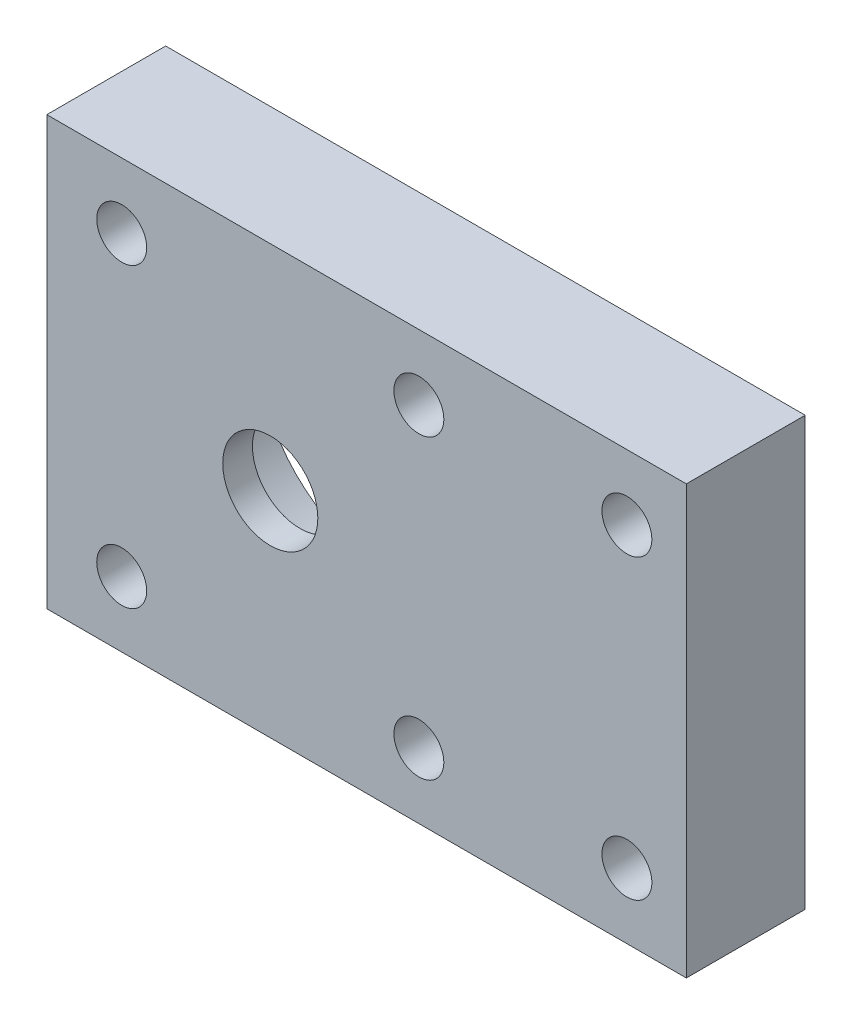
ISO-10303-21;
HEADER;
FILE_DESCRIPTION(('STEP AP214'),'2;1');
FILE_NAME('part.step','',(''),(''),'','','');
FILE_SCHEMA(('AUTOMOTIVE_DESIGN { 1 0 10303 214 1 1 1 1 }'));
ENDSEC;
DATA;
#1=APPLICATION_CONTEXT('core data for automotive mechanical design processes');
#2=APPLICATION_PROTOCOL_DEFINITION('international standard','automotive_design',2000,#1);
#3=PRODUCT_CONTEXT('',#1,'mechanical');
#4=PRODUCT('Part','Part','',(#3));
#5=PRODUCT_RELATED_PRODUCT_CATEGORY('part','',(#4));
#6=PRODUCT_DEFINITION_FORMATION('','',#4);
#7=PRODUCT_DEFINITION_CONTEXT('part definition',#1,'design');
#8=PRODUCT_DEFINITION('design','',#6,#7);
#9=PRODUCT_DEFINITION_SHAPE('','',#8);
#10=(LENGTH_UNIT() NAMED_UNIT(*) SI_UNIT(.MILLI.,.METRE.));
#11=(NAMED_UNIT(*) PLANE_ANGLE_UNIT() SI_UNIT($,.RADIAN.));
#12=(NAMED_UNIT(*) SI_UNIT($,.STERADIAN.) SOLID_ANGLE_UNIT());
#13=UNCERTAINTY_MEASURE_WITH_UNIT(LENGTH_MEASURE(1.E-05),#10,'distance_accuracy_value','');
#14=(GEOMETRIC_REPRESENTATION_CONTEXT(3) GLOBAL_UNCERTAINTY_ASSIGNED_CONTEXT((#13)) GLOBAL_UNIT_ASSIGNED_CONTEXT((#10,
#11,#12)) REPRESENTATION_CONTEXT('',''));
#15=CARTESIAN_POINT('',(0.,0.,0.));
#16=DIRECTION('',(0.,0.,1.));
#17=DIRECTION('',(1.,0.,0.));
#18=AXIS2_PLACEMENT_3D('',#15,#16,#17);
#19=CARTESIAN_POINT('',(0.,0.,10.));
#20=DIRECTION('',(0.,0.,1.));
#21=DIRECTION('',(1.,0.,0.));
#22=AXIS2_PLACEMENT_3D('',#19,#20,#21);
#23=PLANE('',#22);
#24=CARTESIAN_POINT('',(-5.,7.49999999999999,10.));
#25=DIRECTION('',(0.,0.,1.));
#26=DIRECTION('',(-1.,0.,0.));
#27=AXIS2_PLACEMENT_3D('',#24,#25,#26);
#28=CIRCLE('',#27,2.1);
#29=CARTESIAN_POINT('',(-7.09999999999999,7.49999999999999,10.));
#30=VERTEX_POINT('',#29);
#31=EDGE_CURVE('E125',#30,#30,#28,.T.);
#32=ORIENTED_EDGE('',*,*,#31,.F.);
#33=EDGE_LOOP('',(#32));
#34=FACE_BOUND('',#33,.T.);
#35=CARTESIAN_POINT('',(-22.5,7.5,10.));
#36=DIRECTION('',(0.,0.,1.));
#37=DIRECTION('',(1.,0.,0.));
#38=AXIS2_PLACEMENT_3D('',#35,#36,#37);
#39=CIRCLE('',#38,2.1);
#40=CARTESIAN_POINT('',(-20.4,7.5,10.));
#41=VERTEX_POINT('',#40);
#42=EDGE_CURVE('E113',#41,#41,#39,.T.);
#43=ORIENTED_EDGE('',*,*,#42,.F.);
#44=EDGE_LOOP('',(#43));
#45=FACE_BOUND('',#44,.T.);
#46=CARTESIAN_POINT('',(-47.5,7.49999999999998,10.));
#47=DIRECTION('',(0.,0.,1.));
#48=DIRECTION('',(-1.,0.,0.));
#49=AXIS2_PLACEMENT_3D('',#46,#47,#48);
#50=CIRCLE('',#49,2.1);
#51=CARTESIAN_POINT('',(-49.6,7.49999999999998,10.));
#52=VERTEX_POINT('',#51);
#53=EDGE_CURVE('E102',#52,#52,#50,.T.);
#54=ORIENTED_EDGE('',*,*,#53,.F.);
#55=EDGE_LOOP('',(#54));
#56=FACE_BOUND('',#55,.T.);
#57=CARTESIAN_POINT('',(-22.5,32.5,10.));
#58=DIRECTION('',(0.,0.,1.));
#59=DIRECTION('',(1.,0.,0.));
#60=AXIS2_PLACEMENT_3D('',#57,#58,#59);
#61=CIRCLE('',#60,2.1);
#62=CARTESIAN_POINT('',(-20.4,32.5,10.));
#63=VERTEX_POINT('',#62);
#64=EDGE_CURVE('E94',#63,#63,#61,.T.);
#65=ORIENTED_EDGE('',*,*,#64,.F.);
#66=EDGE_LOOP('',(#65));
#67=FACE_BOUND('',#66,.T.);
#68=CARTESIAN_POINT('',(-47.5,32.5,10.));
#69=DIRECTION('',(0.,0.,1.));
#70=DIRECTION('',(1.,0.,0.));
#71=AXIS2_PLACEMENT_3D('',#68,#69,#70);
#72=CIRCLE('',#71,2.1);
#73=CARTESIAN_POINT('',(-45.4,32.5,10.));
#74=VERTEX_POINT('',#73);
#75=EDGE_CURVE('E107',#74,#74,#72,.T.);
#76=ORIENTED_EDGE('',*,*,#75,.F.);
#77=EDGE_LOOP('',(#76));
#78=FACE_BOUND('',#77,.T.);
#79=CARTESIAN_POINT('',(-5.,32.5,10.));
#80=DIRECTION('',(0.,0.,1.));
#81=DIRECTION('',(1.,0.,0.));
#82=AXIS2_PLACEMENT_3D('',#79,#80,#81);
#83=CIRCLE('',#82,2.1);
#84=CARTESIAN_POINT('',(-2.9,32.5,10.));
#85=VERTEX_POINT('',#84);
#86=EDGE_CURVE('E119',#85,#85,#83,.T.);
#87=ORIENTED_EDGE('',*,*,#86,.F.);
#88=EDGE_LOOP('',(#87));
#89=FACE_BOUND('',#88,.T.);
#90=CARTESIAN_POINT('',(-35.,20.,10.));
#91=DIRECTION('',(0.,0.,1.));
#92=DIRECTION('',(1.,0.,0.));
#93=AXIS2_PLACEMENT_3D('',#90,#91,#92);
#94=CIRCLE('',#93,4.);
#95=CARTESIAN_POINT('',(-31.,20.,10.));
#96=VERTEX_POINT('',#95);
#97=EDGE_CURVE('E131',#96,#96,#94,.T.);
#98=ORIENTED_EDGE('',*,*,#97,.F.);
#99=EDGE_LOOP('',(#98));
#100=FACE_BOUND('',#99,.T.);
#101=DIRECTION('',(0.,1.,0.));
#102=VECTOR('',#101,1.);
#103=CARTESIAN_POINT('',(0.,0.,10.));
#104=LINE('',#103,#102);
#105=CARTESIAN_POINT('',(0.,2.,10.));
#106=VERTEX_POINT('',#105);
#107=CARTESIAN_POINT('',(0.,38.,10.));
#108=VERTEX_POINT('',#107);
#109=EDGE_CURVE('E43',#106,#108,#104,.T.);
#110=ORIENTED_EDGE('',*,*,#109,.T.);
#111=DIRECTION('',(1.,0.,0.));
#112=VECTOR('',#111,1.);
#113=CARTESIAN_POINT('',(-53.8,38.,10.));
#114=LINE('',#113,#112);
#115=CARTESIAN_POINT('',(-53.8,38.,10.));
#116=VERTEX_POINT('',#115);
#117=EDGE_CURVE('E77',#116,#108,#114,.T.);
#118=ORIENTED_EDGE('',*,*,#117,.F.);
#119=DIRECTION('',(0.,-1.,0.));
#120=VECTOR('',#119,1.);
#121=CARTESIAN_POINT('',(-53.8,0.,10.));
#122=LINE('',#121,#120);
#123=CARTESIAN_POINT('',(-53.8,2.,10.));
#124=VERTEX_POINT('',#123);
#125=EDGE_CURVE('E11',#116,#124,#122,.T.);
#126=ORIENTED_EDGE('',*,*,#125,.T.);
#127=DIRECTION('',(-1.,0.,0.));
#128=VECTOR('',#127,1.);
#129=CARTESIAN_POINT('',(0.,2.,10.));
#130=LINE('',#129,#128);
#131=EDGE_CURVE('E140',#106,#124,#130,.T.);
#132=ORIENTED_EDGE('',*,*,#131,.F.);
#133=EDGE_LOOP('',(#110,#118,#126,#132));
#134=FACE_BOUND('',#133,.T.);
#135=ADVANCED_FACE('F34',(#34,#45,#56,#67,#78,#89,#100,#134),#23,.T.);
#136=CARTESIAN_POINT('',(0.,0.,0.));
#137=DIRECTION('',(0.,0.,1.));
#138=DIRECTION('',(1.,0.,0.));
#139=AXIS2_PLACEMENT_3D('',#136,#137,#138);
#140=PLANE('',#139);
#141=CARTESIAN_POINT('',(-34.9999999999993,19.9999999999776,0.));
#142=DIRECTION('',(0.,0.,-1.));
#143=DIRECTION('',(-1.,0.,0.));
#144=AXIS2_PLACEMENT_3D('',#141,#142,#143);
#145=CIRCLE('',#144,11.0000000000071);
#146=CARTESIAN_POINT('',(-46.0000000000064,19.9999999999776,0.));
#147=VERTEX_POINT('',#146);
#148=EDGE_CURVE('E136',#147,#147,#145,.T.);
#149=ORIENTED_EDGE('',*,*,#148,.F.);
#150=EDGE_LOOP('',(#149));
#151=FACE_BOUND('',#150,.T.);
#152=CARTESIAN_POINT('',(-22.5,32.5,0.));
#153=DIRECTION('',(0.,0.,1.));
#154=DIRECTION('',(1.,0.,0.));
#155=AXIS2_PLACEMENT_3D('',#152,#153,#154);
#156=CIRCLE('',#155,2.1);
#157=CARTESIAN_POINT('',(-20.4,32.5,0.));
#158=VERTEX_POINT('',#157);
#159=EDGE_CURVE('E97',#158,#158,#156,.T.);
#160=ORIENTED_EDGE('',*,*,#159,.T.);
#161=EDGE_LOOP('',(#160));
#162=FACE_BOUND('',#161,.T.);
#163=CARTESIAN_POINT('',(-47.5,7.49999999999998,0.));
#164=DIRECTION('',(0.,0.,1.));
#165=DIRECTION('',(-1.,0.,0.));
#166=AXIS2_PLACEMENT_3D('',#163,#164,#165);
#167=CIRCLE('',#166,2.1);
#168=CARTESIAN_POINT('',(-49.6,7.49999999999998,0.));
#169=VERTEX_POINT('',#168);
#170=EDGE_CURVE('E104',#169,#169,#167,.T.);
#171=ORIENTED_EDGE('',*,*,#170,.T.);
#172=EDGE_LOOP('',(#171));
#173=FACE_BOUND('',#172,.T.);
#174=CARTESIAN_POINT('',(-47.5,32.5,0.));
#175=DIRECTION('',(0.,0.,1.));
#176=DIRECTION('',(1.,0.,0.));
#177=AXIS2_PLACEMENT_3D('',#174,#175,#176);
#178=CIRCLE('',#177,2.1);
#179=CARTESIAN_POINT('',(-45.4,32.5,0.));
#180=VERTEX_POINT('',#179);
#181=EDGE_CURVE('E110',#180,#180,#178,.T.);
#182=ORIENTED_EDGE('',*,*,#181,.T.);
#183=EDGE_LOOP('',(#182));
#184=FACE_BOUND('',#183,.T.);
#185=CARTESIAN_POINT('',(-22.5,7.5,0.));
#186=DIRECTION('',(0.,0.,1.));
#187=DIRECTION('',(1.,0.,0.));
#188=AXIS2_PLACEMENT_3D('',#185,#186,#187);
#189=CIRCLE('',#188,2.1);
#190=CARTESIAN_POINT('',(-20.4,7.5,0.));
#191=VERTEX_POINT('',#190);
#192=EDGE_CURVE('E116',#191,#191,#189,.T.);
#193=ORIENTED_EDGE('',*,*,#192,.T.);
#194=EDGE_LOOP('',(#193));
#195=FACE_BOUND('',#194,.T.);
#196=CARTESIAN_POINT('',(-5.,32.5,0.));
#197=DIRECTION('',(0.,0.,1.));
#198=DIRECTION('',(1.,0.,0.));
#199=AXIS2_PLACEMENT_3D('',#196,#197,#198);
#200=CIRCLE('',#199,2.1);
#201=CARTESIAN_POINT('',(-2.9,32.5,0.));
#202=VERTEX_POINT('',#201);
#203=EDGE_CURVE('E122',#202,#202,#200,.T.);
#204=ORIENTED_EDGE('',*,*,#203,.T.);
#205=EDGE_LOOP('',(#204));
#206=FACE_BOUND('',#205,.T.);
#207=CARTESIAN_POINT('',(-5.,7.49999999999999,0.));
#208=DIRECTION('',(0.,0.,1.));
#209=DIRECTION('',(-1.,0.,0.));
#210=AXIS2_PLACEMENT_3D('',#207,#208,#209);
#211=CIRCLE('',#210,2.1);
#212=CARTESIAN_POINT('',(-7.09999999999999,7.49999999999999,0.));
#213=VERTEX_POINT('',#212);
#214=EDGE_CURVE('E128',#213,#213,#211,.T.);
#215=ORIENTED_EDGE('',*,*,#214,.T.);
#216=EDGE_LOOP('',(#215));
#217=FACE_BOUND('',#216,.T.);
#218=DIRECTION('',(-1.,0.,0.));
#219=VECTOR('',#218,1.);
#220=CARTESIAN_POINT('',(0.,38.,0.));
#221=LINE('',#220,#219);
#222=CARTESIAN_POINT('',(0.,38.,0.));
#223=VERTEX_POINT('',#222);
#224=CARTESIAN_POINT('',(-53.8,38.,0.));
#225=VERTEX_POINT('',#224);
#226=EDGE_CURVE('E51',#223,#225,#221,.T.);
#227=ORIENTED_EDGE('',*,*,#226,.F.);
#228=DIRECTION('',(0.,1.,0.));
#229=VECTOR('',#228,1.);
#230=CARTESIAN_POINT('',(0.,0.,0.));
#231=LINE('',#230,#229);
#232=CARTESIAN_POINT('',(0.,2.,0.));
#233=VERTEX_POINT('',#232);
#234=EDGE_CURVE('E88',#233,#223,#231,.T.);
#235=ORIENTED_EDGE('',*,*,#234,.F.);
#236=DIRECTION('',(1.,0.,0.));
#237=VECTOR('',#236,1.);
#238=CARTESIAN_POINT('',(-53.8,2.,0.));
#239=LINE('',#238,#237);
#240=CARTESIAN_POINT('',(-53.8,2.,0.));
#241=VERTEX_POINT('',#240);
#242=EDGE_CURVE('E145',#241,#233,#239,.T.);
#243=ORIENTED_EDGE('',*,*,#242,.F.);
#244=DIRECTION('',(0.,-1.,0.));
#245=VECTOR('',#244,1.);
#246=CARTESIAN_POINT('',(-53.8,0.,0.));
#247=LINE('',#246,#245);
#248=EDGE_CURVE('E89',#225,#241,#247,.T.);
#249=ORIENTED_EDGE('',*,*,#248,.F.);
#250=EDGE_LOOP('',(#227,#235,#243,#249));
#251=FACE_BOUND('',#250,.T.);
#252=ADVANCED_FACE('F86',(#151,#162,#173,#184,#195,#206,#217,#251),#140,.F.);
#253=CARTESIAN_POINT('',(0.,0.,10.));
#254=DIRECTION('',(-1.,0.,0.));
#255=DIRECTION('',(0.,0.,1.));
#256=AXIS2_PLACEMENT_3D('',#253,#254,#255);
#257=PLANE('',#256);
#258=DIRECTION('',(0.,0.,-1.));
#259=VECTOR('',#258,1.);
#260=CARTESIAN_POINT('',(0.,38.,10.));
#261=LINE('',#260,#259);
#262=EDGE_CURVE('E75',#108,#223,#261,.T.);
#263=ORIENTED_EDGE('',*,*,#262,.F.);
#264=ORIENTED_EDGE('',*,*,#109,.F.);
#265=DIRECTION('',(0.,0.,1.));
#266=VECTOR('',#265,1.);
#267=CARTESIAN_POINT('',(0.,2.,0.));
#268=LINE('',#267,#266);
#269=EDGE_CURVE('E93',#233,#106,#268,.T.);
#270=ORIENTED_EDGE('',*,*,#269,.F.);
#271=ORIENTED_EDGE('',*,*,#234,.T.);
#272=EDGE_LOOP('',(#263,#264,#270,#271));
#273=FACE_BOUND('',#272,.T.);
#274=ADVANCED_FACE('F36',(#273),#257,.F.);
#275=CARTESIAN_POINT('',(-53.8,0.,10.));
#276=DIRECTION('',(1.,0.,0.));
#277=DIRECTION('',(0.,0.,-1.));
#278=AXIS2_PLACEMENT_3D('',#275,#276,#277);
#279=PLANE('',#278);
#280=DIRECTION('',(0.,0.,1.));
#281=VECTOR('',#280,1.);
#282=CARTESIAN_POINT('',(-53.8,38.,0.));
#283=LINE('',#282,#281);
#284=EDGE_CURVE('E90',#225,#116,#283,.T.);
#285=ORIENTED_EDGE('',*,*,#284,.F.);
#286=ORIENTED_EDGE('',*,*,#248,.T.);
#287=DIRECTION('',(0.,0.,-1.));
#288=VECTOR('',#287,1.);
#289=CARTESIAN_POINT('',(-53.8,2.,10.));
#290=LINE('',#289,#288);
#291=EDGE_CURVE('E147',#124,#241,#290,.T.);
#292=ORIENTED_EDGE('',*,*,#291,.F.);
#293=ORIENTED_EDGE('',*,*,#125,.F.);
#294=EDGE_LOOP('',(#285,#286,#292,#293));
#295=FACE_BOUND('',#294,.T.);
#296=ADVANCED_FACE('F153',(#295),#279,.F.);
#297=CARTESIAN_POINT('',(-35.,20.,10.));
#298=DIRECTION('',(0.,0.,-1.));
#299=DIRECTION('',(-1.,0.,0.));
#300=AXIS2_PLACEMENT_3D('',#297,#298,#299);
#301=CYLINDRICAL_SURFACE('',#300,4.);
#302=ORIENTED_EDGE('',*,*,#97,.T.);
#303=EDGE_LOOP('',(#302));
#304=FACE_BOUND('',#303,.T.);
#305=CARTESIAN_POINT('',(-35.,20.,7.5));
#306=DIRECTION('',(0.,0.,-1.));
#307=DIRECTION('',(-1.,0.,0.));
#308=AXIS2_PLACEMENT_3D('',#305,#306,#307);
#309=CIRCLE('',#308,4.);
#310=CARTESIAN_POINT('',(-39.,20.,7.5));
#311=VERTEX_POINT('',#310);
#312=EDGE_CURVE('E38',#311,#311,#309,.T.);
#313=ORIENTED_EDGE('',*,*,#312,.T.);
#314=EDGE_LOOP('',(#313));
#315=FACE_BOUND('',#314,.T.);
#316=ADVANCED_FACE('F181',(#304,#315),#301,.F.);
#317=CARTESIAN_POINT('',(-22.5,32.5,10.));
#318=DIRECTION('',(0.,0.,-1.));
#319=DIRECTION('',(-1.,0.,0.));
#320=AXIS2_PLACEMENT_3D('',#317,#318,#319);
#321=CYLINDRICAL_SURFACE('',#320,2.1);
#322=ORIENTED_EDGE('',*,*,#64,.T.);
#323=EDGE_LOOP('',(#322));
#324=FACE_BOUND('',#323,.T.);
#325=ORIENTED_EDGE('',*,*,#159,.F.);
#326=EDGE_LOOP('',(#325));
#327=FACE_BOUND('',#326,.T.);
#328=ADVANCED_FACE('F178',(#324,#327),#321,.F.);
#329=CARTESIAN_POINT('',(-47.5,7.49999999999998,10.));
#330=DIRECTION('',(0.,0.,-1.));
#331=DIRECTION('',(-1.,0.,0.));
#332=AXIS2_PLACEMENT_3D('',#329,#330,#331);
#333=CYLINDRICAL_SURFACE('',#332,2.1);
#334=ORIENTED_EDGE('',*,*,#53,.T.);
#335=EDGE_LOOP('',(#334));
#336=FACE_BOUND('',#335,.T.);
#337=ORIENTED_EDGE('',*,*,#170,.F.);
#338=EDGE_LOOP('',(#337));
#339=FACE_BOUND('',#338,.T.);
#340=ADVANCED_FACE('F266',(#336,#339),#333,.F.);
#341=CARTESIAN_POINT('',(-47.5,32.5,10.));
#342=DIRECTION('',(0.,0.,-1.));
#343=DIRECTION('',(-1.,0.,0.));
#344=AXIS2_PLACEMENT_3D('',#341,#342,#343);
#345=CYLINDRICAL_SURFACE('',#344,2.1);
#346=ORIENTED_EDGE('',*,*,#75,.T.);
#347=EDGE_LOOP('',(#346));
#348=FACE_BOUND('',#347,.T.);
#349=ORIENTED_EDGE('',*,*,#181,.F.);
#350=EDGE_LOOP('',(#349));
#351=FACE_BOUND('',#350,.T.);
#352=ADVANCED_FACE('F256',(#348,#351),#345,.F.);
#353=CARTESIAN_POINT('',(-22.5,7.5,10.));
#354=DIRECTION('',(0.,0.,-1.));
#355=DIRECTION('',(-1.,0.,0.));
#356=AXIS2_PLACEMENT_3D('',#353,#354,#355);
#357=CYLINDRICAL_SURFACE('',#356,2.1);
#358=ORIENTED_EDGE('',*,*,#42,.T.);
#359=EDGE_LOOP('',(#358));
#360=FACE_BOUND('',#359,.T.);
#361=ORIENTED_EDGE('',*,*,#192,.F.);
#362=EDGE_LOOP('',(#361));
#363=FACE_BOUND('',#362,.T.);
#364=ADVANCED_FACE('F246',(#360,#363),#357,.F.);
#365=CARTESIAN_POINT('',(-5.,32.5,10.));
#366=DIRECTION('',(0.,0.,-1.));
#367=DIRECTION('',(-1.,0.,0.));
#368=AXIS2_PLACEMENT_3D('',#365,#366,#367);
#369=CYLINDRICAL_SURFACE('',#368,2.1);
#370=ORIENTED_EDGE('',*,*,#86,.T.);
#371=EDGE_LOOP('',(#370));
#372=FACE_BOUND('',#371,.T.);
#373=ORIENTED_EDGE('',*,*,#203,.F.);
#374=EDGE_LOOP('',(#373));
#375=FACE_BOUND('',#374,.T.);
#376=ADVANCED_FACE('F236',(#372,#375),#369,.F.);
#377=CARTESIAN_POINT('',(-5.,7.49999999999999,10.));
#378=DIRECTION('',(0.,0.,-1.));
#379=DIRECTION('',(-1.,0.,0.));
#380=AXIS2_PLACEMENT_3D('',#377,#378,#379);
#381=CYLINDRICAL_SURFACE('',#380,2.1);
#382=ORIENTED_EDGE('',*,*,#31,.T.);
#383=EDGE_LOOP('',(#382));
#384=FACE_BOUND('',#383,.T.);
#385=ORIENTED_EDGE('',*,*,#214,.F.);
#386=EDGE_LOOP('',(#385));
#387=FACE_BOUND('',#386,.T.);
#388=ADVANCED_FACE('F219',(#384,#387),#381,.F.);
#389=CARTESIAN_POINT('',(-34.9999999999993,19.9999999999776,7.5));
#390=DIRECTION('',(0.,0.,-1.));
#391=DIRECTION('',(-1.,0.,0.));
#392=AXIS2_PLACEMENT_3D('',#389,#390,#391);
#393=CYLINDRICAL_SURFACE('',#392,11.0000000000071);
#394=CARTESIAN_POINT('',(-34.9999999999993,19.9999999999776,7.5));
#395=DIRECTION('',(0.,0.,-1.));
#396=DIRECTION('',(-1.,0.,0.));
#397=AXIS2_PLACEMENT_3D('',#394,#395,#396);
#398=CIRCLE('',#397,11.0000000000071);
#399=CARTESIAN_POINT('',(-46.0000000000064,19.9999999999776,7.5));
#400=VERTEX_POINT('',#399);
#401=EDGE_CURVE('E139',#400,#400,#398,.T.);
#402=ORIENTED_EDGE('',*,*,#401,.F.);
#403=EDGE_LOOP('',(#402));
#404=FACE_BOUND('',#403,.T.);
#405=ORIENTED_EDGE('',*,*,#148,.T.);
#406=EDGE_LOOP('',(#405));
#407=FACE_BOUND('',#406,.T.);
#408=ADVANCED_FACE('F164',(#404,#407),#393,.F.);
#409=CARTESIAN_POINT('',(-34.9999999999993,19.9999999999776,7.5));
#410=DIRECTION('',(0.,0.,-1.));
#411=DIRECTION('',(-1.,0.,0.));
#412=AXIS2_PLACEMENT_3D('',#409,#410,#411);
#413=PLANE('',#412);
#414=ORIENTED_EDGE('',*,*,#312,.F.);
#415=EDGE_LOOP('',(#414));
#416=FACE_BOUND('',#415,.T.);
#417=ORIENTED_EDGE('',*,*,#401,.T.);
#418=EDGE_LOOP('',(#417));
#419=FACE_BOUND('',#418,.T.);
#420=ADVANCED_FACE('F157',(#416,#419),#413,.T.);
#421=CARTESIAN_POINT('',(0.,2.,0.));
#422=DIRECTION('',(0.,-1.,0.));
#423=DIRECTION('',(0.,0.,-1.));
#424=AXIS2_PLACEMENT_3D('',#421,#422,#423);
#425=PLANE('',#424);
#426=ORIENTED_EDGE('',*,*,#291,.T.);
#427=ORIENTED_EDGE('',*,*,#242,.T.);
#428=ORIENTED_EDGE('',*,*,#269,.T.);
#429=ORIENTED_EDGE('',*,*,#131,.T.);
#430=EDGE_LOOP('',(#426,#427,#428,#429));
#431=FACE_BOUND('',#430,.T.);
#432=ADVANCED_FACE('F155',(#431),#425,.T.);
#433=CARTESIAN_POINT('',(0.,38.,0.));
#434=DIRECTION('',(0.,1.,0.));
#435=DIRECTION('',(-1.,0.,0.));
#436=AXIS2_PLACEMENT_3D('',#433,#434,#435);
#437=PLANE('',#436);
#438=ORIENTED_EDGE('',*,*,#262,.T.);
#439=ORIENTED_EDGE('',*,*,#226,.T.);
#440=ORIENTED_EDGE('',*,*,#284,.T.);
#441=ORIENTED_EDGE('',*,*,#117,.T.);
#442=EDGE_LOOP('',(#438,#439,#440,#441));
#443=FACE_BOUND('',#442,.T.);
#444=ADVANCED_FACE('F76',(#443),#437,.T.);
#445=CLOSED_SHELL('',(#135,#252,#274,#296,#316,#328,#340,#352,#364,#376,#388,#408,#420,#432,#444));
#446=MANIFOLD_SOLID_BREP('B2',#445);
#447=ADVANCED_BREP_SHAPE_REPRESENTATION('',(#18,#446),#14);
#448=SHAPE_DEFINITION_REPRESENTATION(#9,#447);
ENDSEC;
END-ISO-10303-21;
